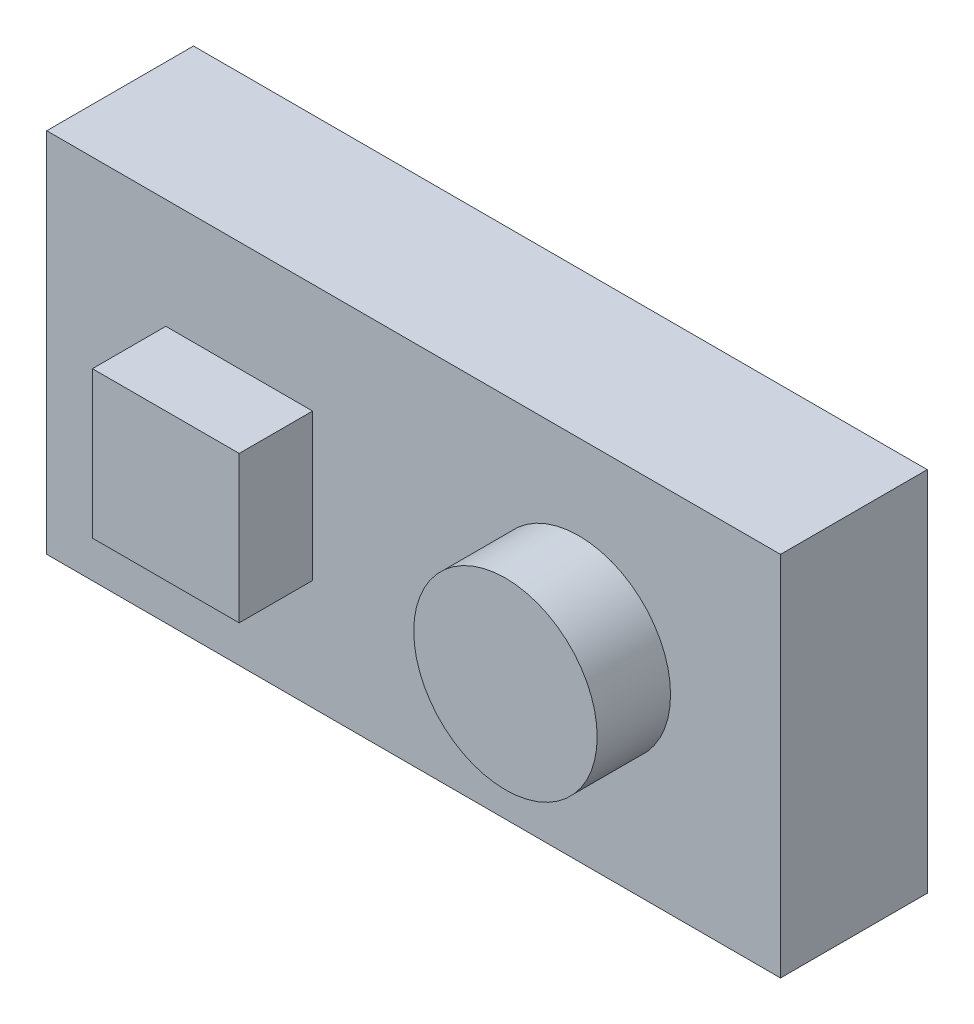
ISO-10303-21;
HEADER;
FILE_DESCRIPTION(('STEP AP214'),'2;1');
FILE_NAME('part.step','',(''),(''),'','','');
FILE_SCHEMA(('AUTOMOTIVE_DESIGN { 1 0 10303 214 1 1 1 1 }'));
ENDSEC;
DATA;
#1=APPLICATION_CONTEXT('core data for automotive mechanical design processes');
#2=APPLICATION_PROTOCOL_DEFINITION('international standard','automotive_design',2000,#1);
#3=PRODUCT_CONTEXT('',#1,'mechanical');
#4=PRODUCT('Part','Part','',(#3));
#5=PRODUCT_RELATED_PRODUCT_CATEGORY('part','',(#4));
#6=PRODUCT_DEFINITION_FORMATION('','',#4);
#7=PRODUCT_DEFINITION_CONTEXT('part definition',#1,'design');
#8=PRODUCT_DEFINITION('design','',#6,#7);
#9=PRODUCT_DEFINITION_SHAPE('','',#8);
#10=(LENGTH_UNIT() NAMED_UNIT(*) SI_UNIT(.MILLI.,.METRE.));
#11=(NAMED_UNIT(*) PLANE_ANGLE_UNIT() SI_UNIT($,.RADIAN.));
#12=(NAMED_UNIT(*) SI_UNIT($,.STERADIAN.) SOLID_ANGLE_UNIT());
#13=UNCERTAINTY_MEASURE_WITH_UNIT(LENGTH_MEASURE(1.E-05),#10,'distance_accuracy_value','');
#14=(GEOMETRIC_REPRESENTATION_CONTEXT(3) GLOBAL_UNCERTAINTY_ASSIGNED_CONTEXT((#13)) GLOBAL_UNIT_ASSIGNED_CONTEXT((#10,
#11,#12)) REPRESENTATION_CONTEXT('',''));
#15=CARTESIAN_POINT('',(0.,0.,0.));
#16=DIRECTION('',(0.,0.,1.));
#17=DIRECTION('',(1.,0.,0.));
#18=AXIS2_PLACEMENT_3D('',#15,#16,#17);
#19=CARTESIAN_POINT('',(0.,0.,20.));
#20=DIRECTION('',(0.,0.,-1.));
#21=DIRECTION('',(-1.,0.,0.));
#22=AXIS2_PLACEMENT_3D('',#19,#20,#21);
#23=PLANE('',#22);
#24=CARTESIAN_POINT('',(72.5158533054634,25.9649651416628,20.));
#25=DIRECTION('',(0.,0.,-1.));
#26=DIRECTION('',(-1.,0.,0.));
#27=AXIS2_PLACEMENT_3D('',#24,#25,#26);
#28=CIRCLE('',#27,12.5);
#29=CARTESIAN_POINT('',(60.0158533054634,25.9649651416628,20.));
#30=VERTEX_POINT('',#29);
#31=EDGE_CURVE('E12',#30,#30,#28,.F.);
#32=ORIENTED_EDGE('',*,*,#31,.F.);
#33=EDGE_LOOP('',(#32));
#34=FACE_BOUND('',#33,.T.);
#35=DIRECTION('',(0.,-1.,0.));
#36=VECTOR('',#35,1.);
#37=CARTESIAN_POINT('',(0.,0.,20.));
#38=LINE('',#37,#36);
#39=CARTESIAN_POINT('',(0.,50.,20.));
#40=VERTEX_POINT('',#39);
#41=CARTESIAN_POINT('',(0.,0.,20.));
#42=VERTEX_POINT('',#41);
#43=EDGE_CURVE('E152',#40,#42,#38,.T.);
#44=ORIENTED_EDGE('',*,*,#43,.T.);
#45=DIRECTION('',(1.,0.,0.));
#46=VECTOR('',#45,1.);
#47=CARTESIAN_POINT('',(0.,0.,20.));
#48=LINE('',#47,#46);
#49=CARTESIAN_POINT('',(100.,0.,20.));
#50=VERTEX_POINT('',#49);
#51=EDGE_CURVE('E208',#42,#50,#48,.T.);
#52=ORIENTED_EDGE('',*,*,#51,.T.);
#53=DIRECTION('',(0.,1.,0.));
#54=VECTOR('',#53,1.);
#55=CARTESIAN_POINT('',(100.,0.,20.));
#56=LINE('',#55,#54);
#57=CARTESIAN_POINT('',(100.,50.,20.));
#58=VERTEX_POINT('',#57);
#59=EDGE_CURVE('E211',#50,#58,#56,.T.);
#60=ORIENTED_EDGE('',*,*,#59,.T.);
#61=DIRECTION('',(-1.,0.,0.));
#62=VECTOR('',#61,1.);
#63=CARTESIAN_POINT('',(0.,50.,20.));
#64=LINE('',#63,#62);
#65=EDGE_CURVE('E215',#58,#40,#64,.T.);
#66=ORIENTED_EDGE('',*,*,#65,.T.);
#67=EDGE_LOOP('',(#44,#52,#60,#66));
#68=FACE_BOUND('',#67,.T.);
#69=DIRECTION('',(0.,-1.,0.));
#70=VECTOR('',#69,1.);
#71=CARTESIAN_POINT('',(16.2262200418049,35.028693536152,20.));
#72=LINE('',#71,#70);
#73=CARTESIAN_POINT('',(16.2262200418049,35.028693536152,20.));
#74=VERTEX_POINT('',#73);
#75=CARTESIAN_POINT('',(16.2262200418049,15.028693536152,20.));
#76=VERTEX_POINT('',#75);
#77=EDGE_CURVE('E137',#74,#76,#72,.T.);
#78=ORIENTED_EDGE('',*,*,#77,.F.);
#79=DIRECTION('',(-1.,0.,0.));
#80=VECTOR('',#79,1.);
#81=CARTESIAN_POINT('',(16.2262200418049,35.028693536152,20.));
#82=LINE('',#81,#80);
#83=CARTESIAN_POINT('',(36.2262200418049,35.028693536152,20.));
#84=VERTEX_POINT('',#83);
#85=EDGE_CURVE('E134',#84,#74,#82,.T.);
#86=ORIENTED_EDGE('',*,*,#85,.F.);
#87=DIRECTION('',(0.,1.,0.));
#88=VECTOR('',#87,1.);
#89=CARTESIAN_POINT('',(36.2262200418049,35.028693536152,20.));
#90=LINE('',#89,#88);
#91=CARTESIAN_POINT('',(36.2262200418049,15.028693536152,20.));
#92=VERTEX_POINT('',#91);
#93=EDGE_CURVE('E69',#92,#84,#90,.T.);
#94=ORIENTED_EDGE('',*,*,#93,.F.);
#95=DIRECTION('',(1.,0.,0.));
#96=VECTOR('',#95,1.);
#97=CARTESIAN_POINT('',(16.2262200418049,15.028693536152,20.));
#98=LINE('',#97,#96);
#99=EDGE_CURVE('E64',#76,#92,#98,.T.);
#100=ORIENTED_EDGE('',*,*,#99,.F.);
#101=EDGE_LOOP('',(#78,#86,#94,#100));
#102=FACE_BOUND('',#101,.T.);
#103=ADVANCED_FACE('F48',(#34,#68,#102),#23,.F.);
#104=CARTESIAN_POINT('',(0.,0.,20.));
#105=DIRECTION('',(1.,0.,0.));
#106=DIRECTION('',(0.,0.,-1.));
#107=AXIS2_PLACEMENT_3D('',#104,#105,#106);
#108=PLANE('',#107);
#109=DIRECTION('',(0.,-1.,0.));
#110=VECTOR('',#109,1.);
#111=CARTESIAN_POINT('',(0.,0.,0.));
#112=LINE('',#111,#110);
#113=CARTESIAN_POINT('',(0.,50.,0.));
#114=VERTEX_POINT('',#113);
#115=CARTESIAN_POINT('',(0.,0.,0.));
#116=VERTEX_POINT('',#115);
#117=EDGE_CURVE('E139',#114,#116,#112,.T.);
#118=ORIENTED_EDGE('',*,*,#117,.T.);
#119=DIRECTION('',(0.,0.,-1.));
#120=VECTOR('',#119,1.);
#121=CARTESIAN_POINT('',(0.,0.,20.));
#122=LINE('',#121,#120);
#123=EDGE_CURVE('E57',#42,#116,#122,.T.);
#124=ORIENTED_EDGE('',*,*,#123,.F.);
#125=ORIENTED_EDGE('',*,*,#43,.F.);
#126=DIRECTION('',(0.,0.,-1.));
#127=VECTOR('',#126,1.);
#128=CARTESIAN_POINT('',(0.,50.,20.));
#129=LINE('',#128,#127);
#130=EDGE_CURVE('E218',#40,#114,#129,.T.);
#131=ORIENTED_EDGE('',*,*,#130,.T.);
#132=EDGE_LOOP('',(#118,#124,#125,#131));
#133=FACE_BOUND('',#132,.T.);
#134=ADVANCED_FACE('F50',(#133),#108,.F.);
#135=CARTESIAN_POINT('',(0.,0.,20.));
#136=DIRECTION('',(0.,1.,0.));
#137=DIRECTION('',(0.,0.,1.));
#138=AXIS2_PLACEMENT_3D('',#135,#136,#137);
#139=PLANE('',#138);
#140=DIRECTION('',(1.,0.,0.));
#141=VECTOR('',#140,1.);
#142=CARTESIAN_POINT('',(0.,0.,0.));
#143=LINE('',#142,#141);
#144=CARTESIAN_POINT('',(100.,0.,0.));
#145=VERTEX_POINT('',#144);
#146=EDGE_CURVE('E144',#116,#145,#143,.T.);
#147=ORIENTED_EDGE('',*,*,#146,.T.);
#148=DIRECTION('',(0.,0.,-1.));
#149=VECTOR('',#148,1.);
#150=CARTESIAN_POINT('',(100.,0.,20.));
#151=LINE('',#150,#149);
#152=EDGE_CURVE('E241',#50,#145,#151,.T.);
#153=ORIENTED_EDGE('',*,*,#152,.F.);
#154=ORIENTED_EDGE('',*,*,#51,.F.);
#155=ORIENTED_EDGE('',*,*,#123,.T.);
#156=EDGE_LOOP('',(#147,#153,#154,#155));
#157=FACE_BOUND('',#156,.T.);
#158=ADVANCED_FACE('F248',(#157),#139,.F.);
#159=CARTESIAN_POINT('',(100.,0.,20.));
#160=DIRECTION('',(-1.,0.,0.));
#161=DIRECTION('',(0.,0.,1.));
#162=AXIS2_PLACEMENT_3D('',#159,#160,#161);
#163=PLANE('',#162);
#164=DIRECTION('',(0.,1.,0.));
#165=VECTOR('',#164,1.);
#166=CARTESIAN_POINT('',(100.,0.,0.));
#167=LINE('',#166,#165);
#168=CARTESIAN_POINT('',(100.,50.,0.));
#169=VERTEX_POINT('',#168);
#170=EDGE_CURVE('E232',#145,#169,#167,.T.);
#171=ORIENTED_EDGE('',*,*,#170,.T.);
#172=DIRECTION('',(0.,0.,-1.));
#173=VECTOR('',#172,1.);
#174=CARTESIAN_POINT('',(100.,50.,20.));
#175=LINE('',#174,#173);
#176=EDGE_CURVE('E237',#58,#169,#175,.T.);
#177=ORIENTED_EDGE('',*,*,#176,.F.);
#178=ORIENTED_EDGE('',*,*,#59,.F.);
#179=ORIENTED_EDGE('',*,*,#152,.T.);
#180=EDGE_LOOP('',(#171,#177,#178,#179));
#181=FACE_BOUND('',#180,.T.);
#182=ADVANCED_FACE('F263',(#181),#163,.F.);
#183=CARTESIAN_POINT('',(0.,50.,20.));
#184=DIRECTION('',(0.,-1.,0.));
#185=DIRECTION('',(0.,0.,-1.));
#186=AXIS2_PLACEMENT_3D('',#183,#184,#185);
#187=PLANE('',#186);
#188=DIRECTION('',(-1.,0.,0.));
#189=VECTOR('',#188,1.);
#190=CARTESIAN_POINT('',(0.,50.,0.));
#191=LINE('',#190,#189);
#192=EDGE_CURVE('E228',#169,#114,#191,.T.);
#193=ORIENTED_EDGE('',*,*,#192,.T.);
#194=ORIENTED_EDGE('',*,*,#130,.F.);
#195=ORIENTED_EDGE('',*,*,#65,.F.);
#196=ORIENTED_EDGE('',*,*,#176,.T.);
#197=EDGE_LOOP('',(#193,#194,#195,#196));
#198=FACE_BOUND('',#197,.T.);
#199=ADVANCED_FACE('F267',(#198),#187,.F.);
#200=CARTESIAN_POINT('',(0.,0.,0.));
#201=DIRECTION('',(0.,0.,-1.));
#202=DIRECTION('',(-1.,0.,0.));
#203=AXIS2_PLACEMENT_3D('',#200,#201,#202);
#204=PLANE('',#203);
#205=ORIENTED_EDGE('',*,*,#117,.F.);
#206=ORIENTED_EDGE('',*,*,#192,.F.);
#207=ORIENTED_EDGE('',*,*,#170,.F.);
#208=ORIENTED_EDGE('',*,*,#146,.F.);
#209=EDGE_LOOP('',(#205,#206,#207,#208));
#210=FACE_BOUND('',#209,.T.);
#211=ADVANCED_FACE('F257',(#210),#204,.T.);
#212=CARTESIAN_POINT('',(16.2262200418049,35.028693536152,30.));
#213=DIRECTION('',(1.,0.,0.));
#214=DIRECTION('',(0.,0.,-1.));
#215=AXIS2_PLACEMENT_3D('',#212,#213,#214);
#216=PLANE('',#215);
#217=ORIENTED_EDGE('',*,*,#77,.T.);
#218=DIRECTION('',(0.,0.,-1.));
#219=VECTOR('',#218,1.);
#220=CARTESIAN_POINT('',(16.2262200418049,15.028693536152,30.));
#221=LINE('',#220,#219);
#222=CARTESIAN_POINT('',(16.2262200418049,15.028693536152,30.));
#223=VERTEX_POINT('',#222);
#224=EDGE_CURVE('E115',#223,#76,#221,.T.);
#225=ORIENTED_EDGE('',*,*,#224,.F.);
#226=DIRECTION('',(0.,-1.,0.));
#227=VECTOR('',#226,1.);
#228=CARTESIAN_POINT('',(16.2262200418049,35.028693536152,30.));
#229=LINE('',#228,#227);
#230=CARTESIAN_POINT('',(16.2262200418049,35.028693536152,30.));
#231=VERTEX_POINT('',#230);
#232=EDGE_CURVE('E123',#231,#223,#229,.T.);
#233=ORIENTED_EDGE('',*,*,#232,.F.);
#234=DIRECTION('',(0.,0.,-1.));
#235=VECTOR('',#234,1.);
#236=CARTESIAN_POINT('',(16.2262200418049,35.028693536152,30.));
#237=LINE('',#236,#235);
#238=EDGE_CURVE('E163',#231,#74,#237,.T.);
#239=ORIENTED_EDGE('',*,*,#238,.T.);
#240=EDGE_LOOP('',(#217,#225,#233,#239));
#241=FACE_BOUND('',#240,.T.);
#242=ADVANCED_FACE('F136',(#241),#216,.F.);
#243=CARTESIAN_POINT('',(16.2262200418049,15.028693536152,30.));
#244=DIRECTION('',(0.,1.,0.));
#245=DIRECTION('',(0.,0.,1.));
#246=AXIS2_PLACEMENT_3D('',#243,#244,#245);
#247=PLANE('',#246);
#248=ORIENTED_EDGE('',*,*,#99,.T.);
#249=DIRECTION('',(0.,0.,-1.));
#250=VECTOR('',#249,1.);
#251=CARTESIAN_POINT('',(36.2262200418049,15.028693536152,30.));
#252=LINE('',#251,#250);
#253=CARTESIAN_POINT('',(36.2262200418049,15.028693536152,30.));
#254=VERTEX_POINT('',#253);
#255=EDGE_CURVE('E118',#254,#92,#252,.T.);
#256=ORIENTED_EDGE('',*,*,#255,.F.);
#257=DIRECTION('',(1.,0.,0.));
#258=VECTOR('',#257,1.);
#259=CARTESIAN_POINT('',(16.2262200418049,15.028693536152,30.));
#260=LINE('',#259,#258);
#261=EDGE_CURVE('E111',#223,#254,#260,.T.);
#262=ORIENTED_EDGE('',*,*,#261,.F.);
#263=ORIENTED_EDGE('',*,*,#224,.T.);
#264=EDGE_LOOP('',(#248,#256,#262,#263));
#265=FACE_BOUND('',#264,.T.);
#266=ADVANCED_FACE('F113',(#265),#247,.F.);
#267=CARTESIAN_POINT('',(36.2262200418049,35.028693536152,30.));
#268=DIRECTION('',(-1.,0.,0.));
#269=DIRECTION('',(0.,-1.,0.));
#270=AXIS2_PLACEMENT_3D('',#267,#268,#269);
#271=PLANE('',#270);
#272=ORIENTED_EDGE('',*,*,#93,.T.);
#273=DIRECTION('',(0.,0.,-1.));
#274=VECTOR('',#273,1.);
#275=CARTESIAN_POINT('',(36.2262200418049,35.028693536152,30.));
#276=LINE('',#275,#274);
#277=CARTESIAN_POINT('',(36.2262200418049,35.028693536152,30.));
#278=VERTEX_POINT('',#277);
#279=EDGE_CURVE('E146',#278,#84,#276,.T.);
#280=ORIENTED_EDGE('',*,*,#279,.F.);
#281=DIRECTION('',(0.,1.,0.));
#282=VECTOR('',#281,1.);
#283=CARTESIAN_POINT('',(36.2262200418049,35.028693536152,30.));
#284=LINE('',#283,#282);
#285=EDGE_CURVE('E122',#254,#278,#284,.T.);
#286=ORIENTED_EDGE('',*,*,#285,.F.);
#287=ORIENTED_EDGE('',*,*,#255,.T.);
#288=EDGE_LOOP('',(#272,#280,#286,#287));
#289=FACE_BOUND('',#288,.T.);
#290=ADVANCED_FACE('F177',(#289),#271,.F.);
#291=CARTESIAN_POINT('',(16.2262200418049,35.028693536152,30.));
#292=DIRECTION('',(0.,-1.,0.));
#293=DIRECTION('',(0.,0.,-1.));
#294=AXIS2_PLACEMENT_3D('',#291,#292,#293);
#295=PLANE('',#294);
#296=ORIENTED_EDGE('',*,*,#85,.T.);
#297=ORIENTED_EDGE('',*,*,#238,.F.);
#298=DIRECTION('',(-1.,0.,0.));
#299=VECTOR('',#298,1.);
#300=CARTESIAN_POINT('',(16.2262200418049,35.028693536152,30.));
#301=LINE('',#300,#299);
#302=EDGE_CURVE('E129',#278,#231,#301,.T.);
#303=ORIENTED_EDGE('',*,*,#302,.F.);
#304=ORIENTED_EDGE('',*,*,#279,.T.);
#305=EDGE_LOOP('',(#296,#297,#303,#304));
#306=FACE_BOUND('',#305,.T.);
#307=ADVANCED_FACE('F175',(#306),#295,.F.);
#308=CARTESIAN_POINT('',(0.,0.,30.));
#309=DIRECTION('',(0.,0.,1.));
#310=DIRECTION('',(1.,0.,0.));
#311=AXIS2_PLACEMENT_3D('',#308,#309,#310);
#312=PLANE('',#311);
#313=ORIENTED_EDGE('',*,*,#232,.T.);
#314=ORIENTED_EDGE('',*,*,#261,.T.);
#315=ORIENTED_EDGE('',*,*,#285,.T.);
#316=ORIENTED_EDGE('',*,*,#302,.T.);
#317=EDGE_LOOP('',(#313,#314,#315,#316));
#318=FACE_BOUND('',#317,.T.);
#319=ADVANCED_FACE('F127',(#318),#312,.T.);
#320=CARTESIAN_POINT('',(72.5158533054634,25.9649651416628,30.));
#321=DIRECTION('',(0.,0.,-1.));
#322=DIRECTION('',(-1.,0.,0.));
#323=AXIS2_PLACEMENT_3D('',#320,#321,#322);
#324=CYLINDRICAL_SURFACE('',#323,12.5);
#325=CARTESIAN_POINT('',(72.5158533054634,25.9649651416628,30.));
#326=DIRECTION('',(0.,0.,1.));
#327=DIRECTION('',(1.,0.,0.));
#328=AXIS2_PLACEMENT_3D('',#325,#326,#327);
#329=CIRCLE('',#328,12.5);
#330=CARTESIAN_POINT('',(85.0158533054634,25.9649651416628,30.));
#331=VERTEX_POINT('',#330);
#332=EDGE_CURVE('E193',#331,#331,#329,.T.);
#333=ORIENTED_EDGE('',*,*,#332,.F.);
#334=EDGE_LOOP('',(#333));
#335=FACE_BOUND('',#334,.T.);
#336=ORIENTED_EDGE('',*,*,#31,.T.);
#337=EDGE_LOOP('',(#336));
#338=FACE_BOUND('',#337,.T.);
#339=ADVANCED_FACE('F288',(#335,#338),#324,.T.);
#340=CARTESIAN_POINT('',(72.5158533054634,25.9649651416628,30.));
#341=DIRECTION('',(0.,0.,1.));
#342=DIRECTION('',(1.,0.,0.));
#343=AXIS2_PLACEMENT_3D('',#340,#341,#342);
#344=PLANE('',#343);
#345=ORIENTED_EDGE('',*,*,#332,.T.);
#346=EDGE_LOOP('',(#345));
#347=FACE_BOUND('',#346,.T.);
#348=ADVANCED_FACE('F283',(#347),#344,.T.);
#349=CLOSED_SHELL('',(#103,#134,#158,#182,#199,#211,#242,#266,#290,#307,#319,#339,#348));
#350=MANIFOLD_SOLID_BREP('B2',#349);
#351=ADVANCED_BREP_SHAPE_REPRESENTATION('',(#18,#350),#14);
#352=SHAPE_DEFINITION_REPRESENTATION(#9,#351);
ENDSEC;
END-ISO-10303-21;
